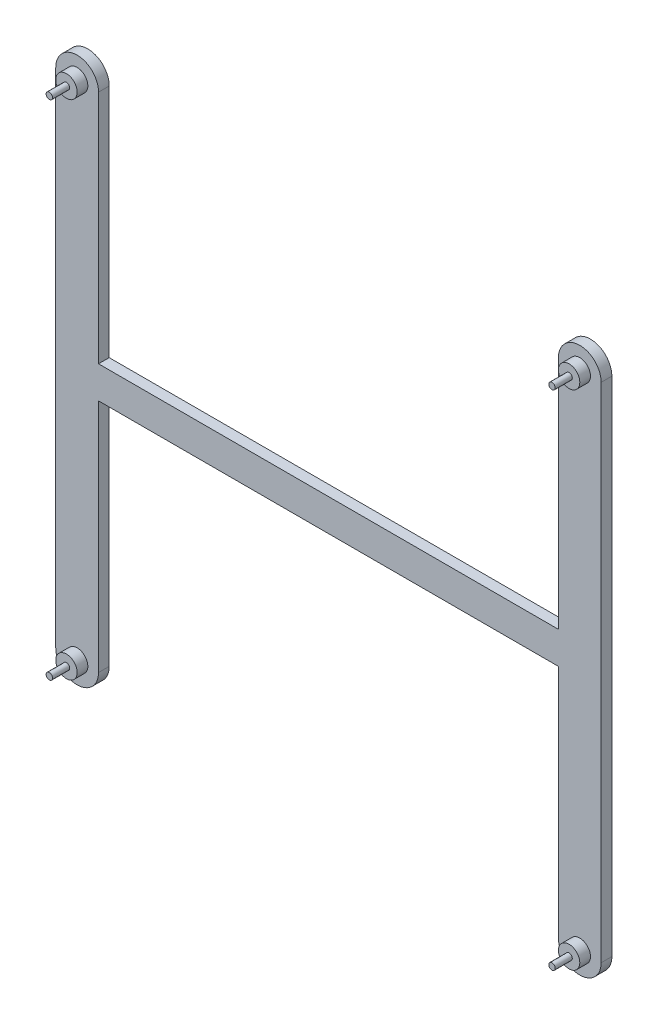
ISO-10303-21;
HEADER;
FILE_DESCRIPTION(('STEP AP214'),'2;1');
FILE_NAME('part.step','',(''),(''),'','','');
FILE_SCHEMA(('AUTOMOTIVE_DESIGN { 1 0 10303 214 1 1 1 1 }'));
ENDSEC;
DATA;
#1=APPLICATION_CONTEXT('core data for automotive mechanical design processes');
#2=APPLICATION_PROTOCOL_DEFINITION('international standard','automotive_design',2000,#1);
#3=PRODUCT_CONTEXT('',#1,'mechanical');
#4=PRODUCT('Part','Part','',(#3));
#5=PRODUCT_RELATED_PRODUCT_CATEGORY('part','',(#4));
#6=PRODUCT_DEFINITION_FORMATION('','',#4);
#7=PRODUCT_DEFINITION_CONTEXT('part definition',#1,'design');
#8=PRODUCT_DEFINITION('design','',#6,#7);
#9=PRODUCT_DEFINITION_SHAPE('','',#8);
#10=(LENGTH_UNIT() NAMED_UNIT(*) SI_UNIT(.MILLI.,.METRE.));
#11=(NAMED_UNIT(*) PLANE_ANGLE_UNIT() SI_UNIT($,.RADIAN.));
#12=(NAMED_UNIT(*) SI_UNIT($,.STERADIAN.) SOLID_ANGLE_UNIT());
#13=UNCERTAINTY_MEASURE_WITH_UNIT(LENGTH_MEASURE(1.E-05),#10,'distance_accuracy_value','');
#14=(GEOMETRIC_REPRESENTATION_CONTEXT(3) GLOBAL_UNCERTAINTY_ASSIGNED_CONTEXT((#13)) GLOBAL_UNIT_ASSIGNED_CONTEXT((#10,
#11,#12)) REPRESENTATION_CONTEXT('',''));
#15=CARTESIAN_POINT('',(0.,0.,0.));
#16=DIRECTION('',(0.,0.,1.));
#17=DIRECTION('',(1.,0.,0.));
#18=AXIS2_PLACEMENT_3D('',#15,#16,#17);
#19=CARTESIAN_POINT('',(107.5,117.5,5.));
#20=DIRECTION('',(1.,0.,0.));
#21=DIRECTION('',(0.,1.,0.));
#22=AXIS2_PLACEMENT_3D('',#19,#20,#21);
#23=PLANE('',#22);
#24=DIRECTION('',(0.,-1.,0.));
#25=VECTOR('',#24,1.);
#26=CARTESIAN_POINT('',(107.5,117.5,0.));
#27=LINE('',#26,#25);
#28=CARTESIAN_POINT('',(107.5,117.5,0.));
#29=VERTEX_POINT('',#28);
#30=CARTESIAN_POINT('',(107.5,7.50000000000006,0.));
#31=VERTEX_POINT('',#30);
#32=EDGE_CURVE('E160',#29,#31,#27,.T.);
#33=ORIENTED_EDGE('',*,*,#32,.T.);
#34=DIRECTION('',(0.,0.,-1.));
#35=VECTOR('',#34,1.);
#36=CARTESIAN_POINT('',(107.5,7.50000000000006,5.));
#37=LINE('',#36,#35);
#38=CARTESIAN_POINT('',(107.5,7.50000000000006,5.));
#39=VERTEX_POINT('',#38);
#40=EDGE_CURVE('E40',#39,#31,#37,.T.);
#41=ORIENTED_EDGE('',*,*,#40,.F.);
#42=DIRECTION('',(0.,-1.,0.));
#43=VECTOR('',#42,1.);
#44=CARTESIAN_POINT('',(107.5,117.5,5.));
#45=LINE('',#44,#43);
#46=CARTESIAN_POINT('',(107.5,117.5,5.));
#47=VERTEX_POINT('',#46);
#48=EDGE_CURVE('E183',#47,#39,#45,.T.);
#49=ORIENTED_EDGE('',*,*,#48,.F.);
#50=DIRECTION('',(0.,0.,-1.));
#51=VECTOR('',#50,1.);
#52=CARTESIAN_POINT('',(107.5,117.5,5.));
#53=LINE('',#52,#51);
#54=EDGE_CURVE('E156',#47,#29,#53,.T.);
#55=ORIENTED_EDGE('',*,*,#54,.T.);
#56=EDGE_LOOP('',(#33,#41,#49,#55));
#57=FACE_BOUND('',#56,.T.);
#58=ADVANCED_FACE('F37',(#57),#23,.F.);
#59=CARTESIAN_POINT('',(-107.499999999998,7.49999999999993,5.));
#60=DIRECTION('',(0.,-1.,0.));
#61=DIRECTION('',(1.,0.,0.));
#62=AXIS2_PLACEMENT_3D('',#59,#60,#61);
#63=PLANE('',#62);
#64=DIRECTION('',(-1.,0.,0.));
#65=VECTOR('',#64,1.);
#66=CARTESIAN_POINT('',(-107.499999999998,7.49999999999993,0.));
#67=LINE('',#66,#65);
#68=CARTESIAN_POINT('',(-107.499999999998,7.49999999999993,0.));
#69=VERTEX_POINT('',#68);
#70=EDGE_CURVE('E163',#31,#69,#67,.T.);
#71=ORIENTED_EDGE('',*,*,#70,.T.);
#72=DIRECTION('',(0.,0.,-1.));
#73=VECTOR('',#72,1.);
#74=CARTESIAN_POINT('',(-107.499999999998,7.49999999999993,5.));
#75=LINE('',#74,#73);
#76=CARTESIAN_POINT('',(-107.499999999998,7.49999999999993,5.));
#77=VERTEX_POINT('',#76);
#78=EDGE_CURVE('E204',#77,#69,#75,.T.);
#79=ORIENTED_EDGE('',*,*,#78,.F.);
#80=DIRECTION('',(-1.,0.,0.));
#81=VECTOR('',#80,1.);
#82=CARTESIAN_POINT('',(-107.499999999998,7.49999999999993,5.));
#83=LINE('',#82,#81);
#84=EDGE_CURVE('E111',#39,#77,#83,.T.);
#85=ORIENTED_EDGE('',*,*,#84,.F.);
#86=ORIENTED_EDGE('',*,*,#40,.T.);
#87=EDGE_LOOP('',(#71,#79,#85,#86));
#88=FACE_BOUND('',#87,.T.);
#89=ADVANCED_FACE('F284',(#88),#63,.F.);
#90=CARTESIAN_POINT('',(-107.499999999998,117.5,5.));
#91=DIRECTION('',(-1.,0.,0.));
#92=DIRECTION('',(0.,-1.,0.));
#93=AXIS2_PLACEMENT_3D('',#90,#91,#92);
#94=PLANE('',#93);
#95=DIRECTION('',(0.,1.,0.));
#96=VECTOR('',#95,1.);
#97=CARTESIAN_POINT('',(-107.499999999998,117.5,0.));
#98=LINE('',#97,#96);
#99=CARTESIAN_POINT('',(-107.499999999998,117.5,0.));
#100=VERTEX_POINT('',#99);
#101=EDGE_CURVE('E166',#69,#100,#98,.T.);
#102=ORIENTED_EDGE('',*,*,#101,.T.);
#103=DIRECTION('',(0.,0.,-1.));
#104=VECTOR('',#103,1.);
#105=CARTESIAN_POINT('',(-107.499999999998,117.5,5.));
#106=LINE('',#105,#104);
#107=CARTESIAN_POINT('',(-107.499999999998,117.5,5.));
#108=VERTEX_POINT('',#107);
#109=EDGE_CURVE('E202',#108,#100,#106,.T.);
#110=ORIENTED_EDGE('',*,*,#109,.F.);
#111=DIRECTION('',(0.,1.,0.));
#112=VECTOR('',#111,1.);
#113=CARTESIAN_POINT('',(-107.499999999998,117.5,5.));
#114=LINE('',#113,#112);
#115=EDGE_CURVE('E246',#77,#108,#114,.T.);
#116=ORIENTED_EDGE('',*,*,#115,.F.);
#117=ORIENTED_EDGE('',*,*,#78,.T.);
#118=EDGE_LOOP('',(#102,#110,#116,#117));
#119=FACE_BOUND('',#118,.T.);
#120=ADVANCED_FACE('F288',(#119),#94,.F.);
#121=CARTESIAN_POINT('',(-117.499999999998,117.5,5.));
#122=DIRECTION('',(0.,0.,-1.));
#123=DIRECTION('',(-1.,0.,0.));
#124=AXIS2_PLACEMENT_3D('',#121,#122,#123);
#125=CYLINDRICAL_SURFACE('',#124,9.99999999999997);
#126=CARTESIAN_POINT('',(-117.499999999998,117.5,0.));
#127=DIRECTION('',(0.,0.,1.));
#128=DIRECTION('',(1.,0.,0.));
#129=AXIS2_PLACEMENT_3D('',#126,#127,#128);
#130=CIRCLE('',#129,9.99999999999997);
#131=CARTESIAN_POINT('',(-127.499999999998,117.5,0.));
#132=VERTEX_POINT('',#131);
#133=EDGE_CURVE('E168',#100,#132,#130,.T.);
#134=ORIENTED_EDGE('',*,*,#133,.T.);
#135=DIRECTION('',(0.,0.,-1.));
#136=VECTOR('',#135,1.);
#137=CARTESIAN_POINT('',(-127.499999999998,117.5,5.));
#138=LINE('',#137,#136);
#139=CARTESIAN_POINT('',(-127.499999999998,117.5,5.));
#140=VERTEX_POINT('',#139);
#141=EDGE_CURVE('E199',#140,#132,#138,.T.);
#142=ORIENTED_EDGE('',*,*,#141,.F.);
#143=CARTESIAN_POINT('',(-117.499999999998,117.5,5.));
#144=DIRECTION('',(0.,0.,1.));
#145=DIRECTION('',(1.,0.,0.));
#146=AXIS2_PLACEMENT_3D('',#143,#144,#145);
#147=CIRCLE('',#146,9.99999999999997);
#148=EDGE_CURVE('E248',#108,#140,#147,.T.);
#149=ORIENTED_EDGE('',*,*,#148,.F.);
#150=ORIENTED_EDGE('',*,*,#109,.T.);
#151=EDGE_LOOP('',(#134,#142,#149,#150));
#152=FACE_BOUND('',#151,.T.);
#153=ADVANCED_FACE('F292',(#152),#125,.T.);
#154=CARTESIAN_POINT('',(-127.499999999998,117.5,5.));
#155=DIRECTION('',(1.,0.,0.));
#156=DIRECTION('',(0.,1.,0.));
#157=AXIS2_PLACEMENT_3D('',#154,#155,#156);
#158=PLANE('',#157);
#159=DIRECTION('',(0.,-1.,0.));
#160=VECTOR('',#159,1.);
#161=CARTESIAN_POINT('',(-127.499999999998,117.5,0.));
#162=LINE('',#161,#160);
#163=CARTESIAN_POINT('',(-127.499999999998,-117.5,0.));
#164=VERTEX_POINT('',#163);
#165=EDGE_CURVE('E170',#132,#164,#162,.T.);
#166=ORIENTED_EDGE('',*,*,#165,.T.);
#167=DIRECTION('',(0.,0.,-1.));
#168=VECTOR('',#167,1.);
#169=CARTESIAN_POINT('',(-127.499999999998,-117.5,5.));
#170=LINE('',#169,#168);
#171=CARTESIAN_POINT('',(-127.499999999998,-117.5,5.));
#172=VERTEX_POINT('',#171);
#173=EDGE_CURVE('E196',#172,#164,#170,.T.);
#174=ORIENTED_EDGE('',*,*,#173,.F.);
#175=DIRECTION('',(0.,-1.,0.));
#176=VECTOR('',#175,1.);
#177=CARTESIAN_POINT('',(-127.499999999998,117.5,5.));
#178=LINE('',#177,#176);
#179=EDGE_CURVE('E250',#140,#172,#178,.T.);
#180=ORIENTED_EDGE('',*,*,#179,.F.);
#181=ORIENTED_EDGE('',*,*,#141,.T.);
#182=EDGE_LOOP('',(#166,#174,#180,#181));
#183=FACE_BOUND('',#182,.T.);
#184=ADVANCED_FACE('F297',(#183),#158,.F.);
#185=CARTESIAN_POINT('',(-117.499999999998,-117.5,5.));
#186=DIRECTION('',(0.,0.,-1.));
#187=DIRECTION('',(-1.,0.,0.));
#188=AXIS2_PLACEMENT_3D('',#185,#186,#187);
#189=CYLINDRICAL_SURFACE('',#188,9.99999999999997);
#190=CARTESIAN_POINT('',(-117.499999999998,-117.5,0.));
#191=DIRECTION('',(0.,0.,1.));
#192=DIRECTION('',(1.,0.,0.));
#193=AXIS2_PLACEMENT_3D('',#190,#191,#192);
#194=CIRCLE('',#193,9.99999999999997);
#195=CARTESIAN_POINT('',(-107.499999999998,-117.5,0.));
#196=VERTEX_POINT('',#195);
#197=EDGE_CURVE('E172',#164,#196,#194,.T.);
#198=ORIENTED_EDGE('',*,*,#197,.T.);
#199=DIRECTION('',(0.,0.,-1.));
#200=VECTOR('',#199,1.);
#201=CARTESIAN_POINT('',(-107.499999999998,-117.5,5.));
#202=LINE('',#201,#200);
#203=CARTESIAN_POINT('',(-107.499999999998,-117.5,5.));
#204=VERTEX_POINT('',#203);
#205=EDGE_CURVE('E193',#204,#196,#202,.T.);
#206=ORIENTED_EDGE('',*,*,#205,.F.);
#207=CARTESIAN_POINT('',(-117.499999999998,-117.5,5.));
#208=DIRECTION('',(0.,0.,1.));
#209=DIRECTION('',(1.,0.,0.));
#210=AXIS2_PLACEMENT_3D('',#207,#208,#209);
#211=CIRCLE('',#210,9.99999999999997);
#212=EDGE_CURVE('E252',#172,#204,#211,.T.);
#213=ORIENTED_EDGE('',*,*,#212,.F.);
#214=ORIENTED_EDGE('',*,*,#173,.T.);
#215=EDGE_LOOP('',(#198,#206,#213,#214));
#216=FACE_BOUND('',#215,.T.);
#217=ADVANCED_FACE('F301',(#216),#189,.T.);
#218=CARTESIAN_POINT('',(-107.499999999998,-7.49999999999993,5.));
#219=DIRECTION('',(-1.,0.,0.));
#220=DIRECTION('',(0.,-1.,0.));
#221=AXIS2_PLACEMENT_3D('',#218,#219,#220);
#222=PLANE('',#221);
#223=DIRECTION('',(0.,1.,0.));
#224=VECTOR('',#223,1.);
#225=CARTESIAN_POINT('',(-107.499999999998,-7.49999999999993,0.));
#226=LINE('',#225,#224);
#227=CARTESIAN_POINT('',(-107.499999999998,-7.49999999999993,0.));
#228=VERTEX_POINT('',#227);
#229=EDGE_CURVE('E174',#196,#228,#226,.T.);
#230=ORIENTED_EDGE('',*,*,#229,.T.);
#231=DIRECTION('',(0.,0.,-1.));
#232=VECTOR('',#231,1.);
#233=CARTESIAN_POINT('',(-107.499999999998,-7.49999999999993,5.));
#234=LINE('',#233,#232);
#235=CARTESIAN_POINT('',(-107.499999999998,-7.49999999999993,5.));
#236=VERTEX_POINT('',#235);
#237=EDGE_CURVE('E190',#236,#228,#234,.T.);
#238=ORIENTED_EDGE('',*,*,#237,.F.);
#239=DIRECTION('',(0.,1.,0.));
#240=VECTOR('',#239,1.);
#241=CARTESIAN_POINT('',(-107.499999999998,-7.49999999999993,5.));
#242=LINE('',#241,#240);
#243=EDGE_CURVE('E254',#204,#236,#242,.T.);
#244=ORIENTED_EDGE('',*,*,#243,.F.);
#245=ORIENTED_EDGE('',*,*,#205,.T.);
#246=EDGE_LOOP('',(#230,#238,#244,#245));
#247=FACE_BOUND('',#246,.T.);
#248=ADVANCED_FACE('F305',(#247),#222,.F.);
#249=CARTESIAN_POINT('',(-107.499999999998,-7.49999999999993,5.));
#250=DIRECTION('',(0.,1.,0.));
#251=DIRECTION('',(0.,0.,1.));
#252=AXIS2_PLACEMENT_3D('',#249,#250,#251);
#253=PLANE('',#252);
#254=DIRECTION('',(1.,0.,0.));
#255=VECTOR('',#254,1.);
#256=CARTESIAN_POINT('',(-107.499999999998,-7.49999999999993,0.));
#257=LINE('',#256,#255);
#258=CARTESIAN_POINT('',(107.5,-7.49999999999993,0.));
#259=VERTEX_POINT('',#258);
#260=EDGE_CURVE('E176',#228,#259,#257,.T.);
#261=ORIENTED_EDGE('',*,*,#260,.T.);
#262=DIRECTION('',(0.,0.,-1.));
#263=VECTOR('',#262,1.);
#264=CARTESIAN_POINT('',(107.5,-7.49999999999993,5.));
#265=LINE('',#264,#263);
#266=CARTESIAN_POINT('',(107.5,-7.49999999999993,5.));
#267=VERTEX_POINT('',#266);
#268=EDGE_CURVE('E187',#267,#259,#265,.T.);
#269=ORIENTED_EDGE('',*,*,#268,.F.);
#270=DIRECTION('',(1.,0.,0.));
#271=VECTOR('',#270,1.);
#272=CARTESIAN_POINT('',(-107.499999999998,-7.49999999999993,5.));
#273=LINE('',#272,#271);
#274=EDGE_CURVE('E256',#236,#267,#273,.T.);
#275=ORIENTED_EDGE('',*,*,#274,.F.);
#276=ORIENTED_EDGE('',*,*,#237,.T.);
#277=EDGE_LOOP('',(#261,#269,#275,#276));
#278=FACE_BOUND('',#277,.T.);
#279=ADVANCED_FACE('F262',(#278),#253,.F.);
#280=CARTESIAN_POINT('',(107.5,-7.49999999999993,5.));
#281=DIRECTION('',(1.,0.,0.));
#282=DIRECTION('',(0.,0.,-1.));
#283=AXIS2_PLACEMENT_3D('',#280,#281,#282);
#284=PLANE('',#283);
#285=DIRECTION('',(0.,-1.,0.));
#286=VECTOR('',#285,1.);
#287=CARTESIAN_POINT('',(107.5,-7.49999999999993,0.));
#288=LINE('',#287,#286);
#289=CARTESIAN_POINT('',(107.5,-117.5,0.));
#290=VERTEX_POINT('',#289);
#291=EDGE_CURVE('E178',#259,#290,#288,.T.);
#292=ORIENTED_EDGE('',*,*,#291,.T.);
#293=DIRECTION('',(0.,0.,-1.));
#294=VECTOR('',#293,1.);
#295=CARTESIAN_POINT('',(107.5,-117.5,5.));
#296=LINE('',#295,#294);
#297=CARTESIAN_POINT('',(107.5,-117.5,5.));
#298=VERTEX_POINT('',#297);
#299=EDGE_CURVE('E151',#298,#290,#296,.T.);
#300=ORIENTED_EDGE('',*,*,#299,.F.);
#301=DIRECTION('',(0.,-1.,0.));
#302=VECTOR('',#301,1.);
#303=CARTESIAN_POINT('',(107.5,-7.49999999999993,5.));
#304=LINE('',#303,#302);
#305=EDGE_CURVE('E142',#267,#298,#304,.T.);
#306=ORIENTED_EDGE('',*,*,#305,.F.);
#307=ORIENTED_EDGE('',*,*,#268,.T.);
#308=EDGE_LOOP('',(#292,#300,#306,#307));
#309=FACE_BOUND('',#308,.T.);
#310=ADVANCED_FACE('F266',(#309),#284,.F.);
#311=CARTESIAN_POINT('',(117.5,-117.5,5.));
#312=DIRECTION('',(0.,0.,-1.));
#313=DIRECTION('',(-1.,0.,0.));
#314=AXIS2_PLACEMENT_3D('',#311,#312,#313);
#315=CYLINDRICAL_SURFACE('',#314,10.);
#316=CARTESIAN_POINT('',(117.5,-117.5,0.));
#317=DIRECTION('',(0.,0.,1.));
#318=DIRECTION('',(1.,0.,0.));
#319=AXIS2_PLACEMENT_3D('',#316,#317,#318);
#320=CIRCLE('',#319,10.);
#321=CARTESIAN_POINT('',(127.5,-117.5,0.));
#322=VERTEX_POINT('',#321);
#323=EDGE_CURVE('E150',#290,#322,#320,.T.);
#324=ORIENTED_EDGE('',*,*,#323,.T.);
#325=DIRECTION('',(0.,0.,-1.));
#326=VECTOR('',#325,1.);
#327=CARTESIAN_POINT('',(127.5,-117.5,5.));
#328=LINE('',#327,#326);
#329=CARTESIAN_POINT('',(127.5,-117.5,5.));
#330=VERTEX_POINT('',#329);
#331=EDGE_CURVE('E147',#330,#322,#328,.T.);
#332=ORIENTED_EDGE('',*,*,#331,.F.);
#333=CARTESIAN_POINT('',(117.5,-117.5,5.));
#334=DIRECTION('',(0.,0.,1.));
#335=DIRECTION('',(1.,0.,0.));
#336=AXIS2_PLACEMENT_3D('',#333,#334,#335);
#337=CIRCLE('',#336,10.);
#338=EDGE_CURVE('E136',#298,#330,#337,.T.);
#339=ORIENTED_EDGE('',*,*,#338,.F.);
#340=ORIENTED_EDGE('',*,*,#299,.T.);
#341=EDGE_LOOP('',(#324,#332,#339,#340));
#342=FACE_BOUND('',#341,.T.);
#343=ADVANCED_FACE('F148',(#342),#315,.T.);
#344=CARTESIAN_POINT('',(127.5,117.5,5.));
#345=DIRECTION('',(-1.,0.,0.));
#346=DIRECTION('',(0.,-1.,0.));
#347=AXIS2_PLACEMENT_3D('',#344,#345,#346);
#348=PLANE('',#347);
#349=DIRECTION('',(0.,1.,0.));
#350=VECTOR('',#349,1.);
#351=CARTESIAN_POINT('',(127.5,117.5,0.));
#352=LINE('',#351,#350);
#353=CARTESIAN_POINT('',(127.5,117.5,0.));
#354=VERTEX_POINT('',#353);
#355=EDGE_CURVE('E96',#322,#354,#352,.T.);
#356=ORIENTED_EDGE('',*,*,#355,.T.);
#357=DIRECTION('',(0.,0.,-1.));
#358=VECTOR('',#357,1.);
#359=CARTESIAN_POINT('',(127.5,117.5,5.));
#360=LINE('',#359,#358);
#361=CARTESIAN_POINT('',(127.5,117.5,5.));
#362=VERTEX_POINT('',#361);
#363=EDGE_CURVE('E152',#362,#354,#360,.T.);
#364=ORIENTED_EDGE('',*,*,#363,.F.);
#365=DIRECTION('',(0.,1.,0.));
#366=VECTOR('',#365,1.);
#367=CARTESIAN_POINT('',(127.5,117.5,5.));
#368=LINE('',#367,#366);
#369=EDGE_CURVE('E140',#330,#362,#368,.T.);
#370=ORIENTED_EDGE('',*,*,#369,.F.);
#371=ORIENTED_EDGE('',*,*,#331,.T.);
#372=EDGE_LOOP('',(#356,#364,#370,#371));
#373=FACE_BOUND('',#372,.T.);
#374=ADVANCED_FACE('F154',(#373),#348,.F.);
#375=CARTESIAN_POINT('',(117.5,117.5,5.));
#376=DIRECTION('',(0.,0.,-1.));
#377=DIRECTION('',(-1.,0.,0.));
#378=AXIS2_PLACEMENT_3D('',#375,#376,#377);
#379=CYLINDRICAL_SURFACE('',#378,10.);
#380=CARTESIAN_POINT('',(117.5,117.5,0.));
#381=DIRECTION('',(0.,0.,1.));
#382=DIRECTION('',(1.,0.,0.));
#383=AXIS2_PLACEMENT_3D('',#380,#381,#382);
#384=CIRCLE('',#383,10.);
#385=EDGE_CURVE('E102',#354,#29,#384,.T.);
#386=ORIENTED_EDGE('',*,*,#385,.T.);
#387=ORIENTED_EDGE('',*,*,#54,.F.);
#388=CARTESIAN_POINT('',(117.5,117.5,5.));
#389=DIRECTION('',(0.,0.,1.));
#390=DIRECTION('',(1.,0.,0.));
#391=AXIS2_PLACEMENT_3D('',#388,#389,#390);
#392=CIRCLE('',#391,10.);
#393=EDGE_CURVE('E55',#362,#47,#392,.T.);
#394=ORIENTED_EDGE('',*,*,#393,.F.);
#395=ORIENTED_EDGE('',*,*,#363,.T.);
#396=EDGE_LOOP('',(#386,#387,#394,#395));
#397=FACE_BOUND('',#396,.T.);
#398=ADVANCED_FACE('F272',(#397),#379,.T.);
#399=CARTESIAN_POINT('',(-117.499999999998,117.5,5.));
#400=DIRECTION('',(0.,0.,1.));
#401=DIRECTION('',(1.,0.,0.));
#402=AXIS2_PLACEMENT_3D('',#399,#400,#401);
#403=PLANE('',#402);
#404=CARTESIAN_POINT('',(-117.499999999998,-117.5,5.));
#405=DIRECTION('',(0.,0.,1.));
#406=DIRECTION('',(1.,0.,0.));
#407=AXIS2_PLACEMENT_3D('',#404,#405,#406);
#408=CIRCLE('',#407,5.00000000000001);
#409=CARTESIAN_POINT('',(-112.499999999998,-117.5,5.));
#410=VERTEX_POINT('',#409);
#411=EDGE_CURVE('E225',#410,#410,#408,.T.);
#412=ORIENTED_EDGE('',*,*,#411,.F.);
#413=EDGE_LOOP('',(#412));
#414=FACE_BOUND('',#413,.T.);
#415=CARTESIAN_POINT('',(-117.499999999998,117.5,5.));
#416=DIRECTION('',(0.,0.,1.));
#417=DIRECTION('',(1.,0.,0.));
#418=AXIS2_PLACEMENT_3D('',#415,#416,#417);
#419=CIRCLE('',#418,5.00000000000001);
#420=CARTESIAN_POINT('',(-112.499999999998,117.5,5.));
#421=VERTEX_POINT('',#420);
#422=EDGE_CURVE('E224',#421,#421,#419,.T.);
#423=ORIENTED_EDGE('',*,*,#422,.F.);
#424=EDGE_LOOP('',(#423));
#425=FACE_BOUND('',#424,.T.);
#426=CARTESIAN_POINT('',(117.5,117.5,5.));
#427=DIRECTION('',(0.,0.,1.));
#428=DIRECTION('',(1.,0.,0.));
#429=AXIS2_PLACEMENT_3D('',#426,#427,#428);
#430=CIRCLE('',#429,5.00000000000001);
#431=CARTESIAN_POINT('',(122.5,117.5,5.));
#432=VERTEX_POINT('',#431);
#433=EDGE_CURVE('E231',#432,#432,#430,.T.);
#434=ORIENTED_EDGE('',*,*,#433,.F.);
#435=EDGE_LOOP('',(#434));
#436=FACE_BOUND('',#435,.T.);
#437=CARTESIAN_POINT('',(117.5,-117.5,5.));
#438=DIRECTION('',(0.,0.,1.));
#439=DIRECTION('',(1.,0.,0.));
#440=AXIS2_PLACEMENT_3D('',#437,#438,#439);
#441=CIRCLE('',#440,5.00000000000001);
#442=CARTESIAN_POINT('',(122.5,-117.5,5.));
#443=VERTEX_POINT('',#442);
#444=EDGE_CURVE('E237',#443,#443,#441,.T.);
#445=ORIENTED_EDGE('',*,*,#444,.F.);
#446=EDGE_LOOP('',(#445));
#447=FACE_BOUND('',#446,.T.);
#448=ORIENTED_EDGE('',*,*,#48,.T.);
#449=ORIENTED_EDGE('',*,*,#84,.T.);
#450=ORIENTED_EDGE('',*,*,#115,.T.);
#451=ORIENTED_EDGE('',*,*,#148,.T.);
#452=ORIENTED_EDGE('',*,*,#179,.T.);
#453=ORIENTED_EDGE('',*,*,#212,.T.);
#454=ORIENTED_EDGE('',*,*,#243,.T.);
#455=ORIENTED_EDGE('',*,*,#274,.T.);
#456=ORIENTED_EDGE('',*,*,#305,.T.);
#457=ORIENTED_EDGE('',*,*,#338,.T.);
#458=ORIENTED_EDGE('',*,*,#369,.T.);
#459=ORIENTED_EDGE('',*,*,#393,.T.);
#460=EDGE_LOOP('',(#448,#449,#450,#451,#452,#453,#454,#455,#456,#457,#458,#459));
#461=FACE_BOUND('',#460,.T.);
#462=ADVANCED_FACE('F138',(#414,#425,#436,#447,#461),#403,.T.);
#463=CARTESIAN_POINT('',(-117.499999999998,117.5,0.));
#464=DIRECTION('',(0.,0.,1.));
#465=DIRECTION('',(1.,0.,0.));
#466=AXIS2_PLACEMENT_3D('',#463,#464,#465);
#467=PLANE('',#466);
#468=ORIENTED_EDGE('',*,*,#32,.F.);
#469=ORIENTED_EDGE('',*,*,#385,.F.);
#470=ORIENTED_EDGE('',*,*,#355,.F.);
#471=ORIENTED_EDGE('',*,*,#323,.F.);
#472=ORIENTED_EDGE('',*,*,#291,.F.);
#473=ORIENTED_EDGE('',*,*,#260,.F.);
#474=ORIENTED_EDGE('',*,*,#229,.F.);
#475=ORIENTED_EDGE('',*,*,#197,.F.);
#476=ORIENTED_EDGE('',*,*,#165,.F.);
#477=ORIENTED_EDGE('',*,*,#133,.F.);
#478=ORIENTED_EDGE('',*,*,#101,.F.);
#479=ORIENTED_EDGE('',*,*,#70,.F.);
#480=EDGE_LOOP('',(#468,#469,#470,#471,#472,#473,#474,#475,#476,#477,#478,#479));
#481=FACE_BOUND('',#480,.T.);
#482=ADVANCED_FACE('F269',(#481),#467,.F.);
#483=CARTESIAN_POINT('',(117.5,-117.5,10.));
#484=DIRECTION('',(0.,0.,-1.));
#485=DIRECTION('',(-1.,0.,0.));
#486=AXIS2_PLACEMENT_3D('',#483,#484,#485);
#487=CYLINDRICAL_SURFACE('',#486,5.00000000000001);
#488=CARTESIAN_POINT('',(117.5,-117.5,10.));
#489=DIRECTION('',(0.,0.,1.));
#490=DIRECTION('',(1.,0.,0.));
#491=AXIS2_PLACEMENT_3D('',#488,#489,#490);
#492=CIRCLE('',#491,5.00000000000001);
#493=CARTESIAN_POINT('',(122.5,-117.5,10.));
#494=VERTEX_POINT('',#493);
#495=EDGE_CURVE('E164',#494,#494,#492,.T.);
#496=ORIENTED_EDGE('',*,*,#495,.F.);
#497=EDGE_LOOP('',(#496));
#498=FACE_BOUND('',#497,.T.);
#499=ORIENTED_EDGE('',*,*,#444,.T.);
#500=EDGE_LOOP('',(#499));
#501=FACE_BOUND('',#500,.T.);
#502=ADVANCED_FACE('F337',(#498,#501),#487,.T.);
#503=CARTESIAN_POINT('',(117.5,-117.5,10.));
#504=DIRECTION('',(0.,0.,1.));
#505=DIRECTION('',(1.,0.,0.));
#506=AXIS2_PLACEMENT_3D('',#503,#504,#505);
#507=PLANE('',#506);
#508=CARTESIAN_POINT('',(117.5,-117.5,10.));
#509=DIRECTION('',(0.,0.,1.));
#510=DIRECTION('',(1.,0.,0.));
#511=AXIS2_PLACEMENT_3D('',#508,#509,#510);
#512=CIRCLE('',#511,1.5);
#513=CARTESIAN_POINT('',(119.,-117.5,10.));
#514=VERTEX_POINT('',#513);
#515=EDGE_CURVE('E46',#514,#514,#512,.T.);
#516=ORIENTED_EDGE('',*,*,#515,.F.);
#517=EDGE_LOOP('',(#516));
#518=FACE_BOUND('',#517,.T.);
#519=ORIENTED_EDGE('',*,*,#495,.T.);
#520=EDGE_LOOP('',(#519));
#521=FACE_BOUND('',#520,.T.);
#522=ADVANCED_FACE('F350',(#518,#521),#507,.T.);
#523=CARTESIAN_POINT('',(117.5,117.5,10.));
#524=DIRECTION('',(0.,0.,-1.));
#525=DIRECTION('',(-1.,0.,0.));
#526=AXIS2_PLACEMENT_3D('',#523,#524,#525);
#527=CYLINDRICAL_SURFACE('',#526,5.00000000000001);
#528=CARTESIAN_POINT('',(117.5,117.5,10.));
#529=DIRECTION('',(0.,0.,1.));
#530=DIRECTION('',(1.,0.,0.));
#531=AXIS2_PLACEMENT_3D('',#528,#529,#530);
#532=CIRCLE('',#531,5.00000000000001);
#533=CARTESIAN_POINT('',(122.5,117.5,10.));
#534=VERTEX_POINT('',#533);
#535=EDGE_CURVE('E234',#534,#534,#532,.T.);
#536=ORIENTED_EDGE('',*,*,#535,.F.);
#537=EDGE_LOOP('',(#536));
#538=FACE_BOUND('',#537,.T.);
#539=ORIENTED_EDGE('',*,*,#433,.T.);
#540=EDGE_LOOP('',(#539));
#541=FACE_BOUND('',#540,.T.);
#542=ADVANCED_FACE('F358',(#538,#541),#527,.T.);
#543=CARTESIAN_POINT('',(117.5,117.5,10.));
#544=DIRECTION('',(0.,0.,1.));
#545=DIRECTION('',(1.,0.,0.));
#546=AXIS2_PLACEMENT_3D('',#543,#544,#545);
#547=PLANE('',#546);
#548=CARTESIAN_POINT('',(117.5,117.5,10.));
#549=DIRECTION('',(0.,0.,1.));
#550=DIRECTION('',(1.,0.,0.));
#551=AXIS2_PLACEMENT_3D('',#548,#549,#550);
#552=CIRCLE('',#551,1.5);
#553=CARTESIAN_POINT('',(119.,117.5,10.));
#554=VERTEX_POINT('',#553);
#555=EDGE_CURVE('E11',#554,#554,#552,.T.);
#556=ORIENTED_EDGE('',*,*,#555,.F.);
#557=EDGE_LOOP('',(#556));
#558=FACE_BOUND('',#557,.T.);
#559=ORIENTED_EDGE('',*,*,#535,.T.);
#560=EDGE_LOOP('',(#559));
#561=FACE_BOUND('',#560,.T.);
#562=ADVANCED_FACE('F363',(#558,#561),#547,.T.);
#563=CARTESIAN_POINT('',(-117.499999999998,117.5,10.));
#564=DIRECTION('',(0.,0.,-1.));
#565=DIRECTION('',(-1.,0.,0.));
#566=AXIS2_PLACEMENT_3D('',#563,#564,#565);
#567=CYLINDRICAL_SURFACE('',#566,5.00000000000001);
#568=CARTESIAN_POINT('',(-117.499999999998,117.5,10.));
#569=DIRECTION('',(0.,0.,1.));
#570=DIRECTION('',(1.,0.,0.));
#571=AXIS2_PLACEMENT_3D('',#568,#569,#570);
#572=CIRCLE('',#571,5.00000000000001);
#573=CARTESIAN_POINT('',(-112.499999999998,117.5,10.));
#574=VERTEX_POINT('',#573);
#575=EDGE_CURVE('E228',#574,#574,#572,.T.);
#576=ORIENTED_EDGE('',*,*,#575,.F.);
#577=EDGE_LOOP('',(#576));
#578=FACE_BOUND('',#577,.T.);
#579=ORIENTED_EDGE('',*,*,#422,.T.);
#580=EDGE_LOOP('',(#579));
#581=FACE_BOUND('',#580,.T.);
#582=ADVANCED_FACE('F371',(#578,#581),#567,.T.);
#583=CARTESIAN_POINT('',(-117.499999999998,117.5,10.));
#584=DIRECTION('',(0.,0.,1.));
#585=DIRECTION('',(1.,0.,0.));
#586=AXIS2_PLACEMENT_3D('',#583,#584,#585);
#587=PLANE('',#586);
#588=CARTESIAN_POINT('',(-117.499999999998,117.5,10.));
#589=DIRECTION('',(0.,0.,1.));
#590=DIRECTION('',(1.,0.,0.));
#591=AXIS2_PLACEMENT_3D('',#588,#589,#590);
#592=CIRCLE('',#591,1.5);
#593=CARTESIAN_POINT('',(-115.999999999998,117.5,10.));
#594=VERTEX_POINT('',#593);
#595=EDGE_CURVE('E209',#594,#594,#592,.T.);
#596=ORIENTED_EDGE('',*,*,#595,.F.);
#597=EDGE_LOOP('',(#596));
#598=FACE_BOUND('',#597,.T.);
#599=ORIENTED_EDGE('',*,*,#575,.T.);
#600=EDGE_LOOP('',(#599));
#601=FACE_BOUND('',#600,.T.);
#602=ADVANCED_FACE('F376',(#598,#601),#587,.T.);
#603=CARTESIAN_POINT('',(-117.499999999998,-117.5,10.));
#604=DIRECTION('',(0.,0.,-1.));
#605=DIRECTION('',(-1.,0.,0.));
#606=AXIS2_PLACEMENT_3D('',#603,#604,#605);
#607=CYLINDRICAL_SURFACE('',#606,5.00000000000001);
#608=CARTESIAN_POINT('',(-117.499999999998,-117.5,10.));
#609=DIRECTION('',(0.,0.,1.));
#610=DIRECTION('',(1.,0.,0.));
#611=AXIS2_PLACEMENT_3D('',#608,#609,#610);
#612=CIRCLE('',#611,5.00000000000001);
#613=CARTESIAN_POINT('',(-112.499999999998,-117.5,10.));
#614=VERTEX_POINT('',#613);
#615=EDGE_CURVE('E221',#614,#614,#612,.T.);
#616=ORIENTED_EDGE('',*,*,#615,.F.);
#617=EDGE_LOOP('',(#616));
#618=FACE_BOUND('',#617,.T.);
#619=ORIENTED_EDGE('',*,*,#411,.T.);
#620=EDGE_LOOP('',(#619));
#621=FACE_BOUND('',#620,.T.);
#622=ADVANCED_FACE('F384',(#618,#621),#607,.T.);
#623=CARTESIAN_POINT('',(-117.499999999998,-117.5,10.));
#624=DIRECTION('',(0.,0.,1.));
#625=DIRECTION('',(1.,0.,0.));
#626=AXIS2_PLACEMENT_3D('',#623,#624,#625);
#627=PLANE('',#626);
#628=CARTESIAN_POINT('',(-117.499999999998,-117.5,10.));
#629=DIRECTION('',(0.,0.,1.));
#630=DIRECTION('',(1.,0.,0.));
#631=AXIS2_PLACEMENT_3D('',#628,#629,#630);
#632=CIRCLE('',#631,1.5);
#633=CARTESIAN_POINT('',(-115.999999999998,-117.5,10.));
#634=VERTEX_POINT('',#633);
#635=EDGE_CURVE('E212',#634,#634,#632,.T.);
#636=ORIENTED_EDGE('',*,*,#635,.F.);
#637=EDGE_LOOP('',(#636));
#638=FACE_BOUND('',#637,.T.);
#639=ORIENTED_EDGE('',*,*,#615,.T.);
#640=EDGE_LOOP('',(#639));
#641=FACE_BOUND('',#640,.T.);
#642=ADVANCED_FACE('F389',(#638,#641),#627,.T.);
#643=CARTESIAN_POINT('',(-117.499999999998,117.5,18.));
#644=DIRECTION('',(0.,0.,-1.));
#645=DIRECTION('',(-1.,0.,0.));
#646=AXIS2_PLACEMENT_3D('',#643,#644,#645);
#647=CYLINDRICAL_SURFACE('',#646,1.5);
#648=CARTESIAN_POINT('',(-117.499999999998,117.5,18.));
#649=DIRECTION('',(0.,0.,1.));
#650=DIRECTION('',(1.,0.,0.));
#651=AXIS2_PLACEMENT_3D('',#648,#649,#650);
#652=CIRCLE('',#651,1.5);
#653=CARTESIAN_POINT('',(-115.999999999998,117.5,18.));
#654=VERTEX_POINT('',#653);
#655=EDGE_CURVE('E220',#654,#654,#652,.T.);
#656=ORIENTED_EDGE('',*,*,#655,.F.);
#657=EDGE_LOOP('',(#656));
#658=FACE_BOUND('',#657,.T.);
#659=ORIENTED_EDGE('',*,*,#595,.T.);
#660=EDGE_LOOP('',(#659));
#661=FACE_BOUND('',#660,.T.);
#662=ADVANCED_FACE('F420',(#658,#661),#647,.T.);
#663=CARTESIAN_POINT('',(-117.499999999998,117.5,18.));
#664=DIRECTION('',(0.,0.,1.));
#665=DIRECTION('',(1.,0.,0.));
#666=AXIS2_PLACEMENT_3D('',#663,#664,#665);
#667=PLANE('',#666);
#668=ORIENTED_EDGE('',*,*,#655,.T.);
#669=EDGE_LOOP('',(#668));
#670=FACE_BOUND('',#669,.T.);
#671=ADVANCED_FACE('F430',(#670),#667,.T.);
#672=CARTESIAN_POINT('',(-117.499999999998,-117.5,18.));
#673=DIRECTION('',(0.,0.,-1.));
#674=DIRECTION('',(-1.,0.,0.));
#675=AXIS2_PLACEMENT_3D('',#672,#673,#674);
#676=CYLINDRICAL_SURFACE('',#675,1.5);
#677=CARTESIAN_POINT('',(-117.499999999998,-117.5,18.));
#678=DIRECTION('',(0.,0.,1.));
#679=DIRECTION('',(1.,0.,0.));
#680=AXIS2_PLACEMENT_3D('',#677,#678,#679);
#681=CIRCLE('',#680,1.5);
#682=CARTESIAN_POINT('',(-115.999999999998,-117.5,18.));
#683=VERTEX_POINT('',#682);
#684=EDGE_CURVE('E510',#683,#683,#681,.T.);
#685=ORIENTED_EDGE('',*,*,#684,.F.);
#686=EDGE_LOOP('',(#685));
#687=FACE_BOUND('',#686,.T.);
#688=ORIENTED_EDGE('',*,*,#635,.T.);
#689=EDGE_LOOP('',(#688));
#690=FACE_BOUND('',#689,.T.);
#691=ADVANCED_FACE('F440',(#687,#690),#676,.T.);
#692=CARTESIAN_POINT('',(-117.499999999998,-117.5,18.));
#693=DIRECTION('',(0.,0.,1.));
#694=DIRECTION('',(1.,0.,0.));
#695=AXIS2_PLACEMENT_3D('',#692,#693,#694);
#696=PLANE('',#695);
#697=ORIENTED_EDGE('',*,*,#684,.T.);
#698=EDGE_LOOP('',(#697));
#699=FACE_BOUND('',#698,.T.);
#700=ADVANCED_FACE('F450',(#699),#696,.T.);
#701=CARTESIAN_POINT('',(117.5,-117.5,18.));
#702=DIRECTION('',(0.,0.,-1.));
#703=DIRECTION('',(-1.,0.,0.));
#704=AXIS2_PLACEMENT_3D('',#701,#702,#703);
#705=CYLINDRICAL_SURFACE('',#704,1.5);
#706=CARTESIAN_POINT('',(117.5,-117.5,18.));
#707=DIRECTION('',(0.,0.,1.));
#708=DIRECTION('',(1.,0.,0.));
#709=AXIS2_PLACEMENT_3D('',#706,#707,#708);
#710=CIRCLE('',#709,1.5);
#711=CARTESIAN_POINT('',(119.,-117.5,18.));
#712=VERTEX_POINT('',#711);
#713=EDGE_CURVE('E507',#712,#712,#710,.T.);
#714=ORIENTED_EDGE('',*,*,#713,.F.);
#715=EDGE_LOOP('',(#714));
#716=FACE_BOUND('',#715,.T.);
#717=ORIENTED_EDGE('',*,*,#515,.T.);
#718=EDGE_LOOP('',(#717));
#719=FACE_BOUND('',#718,.T.);
#720=ADVANCED_FACE('F460',(#716,#719),#705,.T.);
#721=CARTESIAN_POINT('',(117.5,-117.5,18.));
#722=DIRECTION('',(0.,0.,1.));
#723=DIRECTION('',(1.,0.,0.));
#724=AXIS2_PLACEMENT_3D('',#721,#722,#723);
#725=PLANE('',#724);
#726=ORIENTED_EDGE('',*,*,#713,.T.);
#727=EDGE_LOOP('',(#726));
#728=FACE_BOUND('',#727,.T.);
#729=ADVANCED_FACE('F470',(#728),#725,.T.);
#730=CARTESIAN_POINT('',(117.5,117.5,18.));
#731=DIRECTION('',(0.,0.,-1.));
#732=DIRECTION('',(-1.,0.,0.));
#733=AXIS2_PLACEMENT_3D('',#730,#731,#732);
#734=CYLINDRICAL_SURFACE('',#733,1.5);
#735=CARTESIAN_POINT('',(117.5,117.5,18.));
#736=DIRECTION('',(0.,0.,1.));
#737=DIRECTION('',(1.,0.,0.));
#738=AXIS2_PLACEMENT_3D('',#735,#736,#737);
#739=CIRCLE('',#738,1.5);
#740=CARTESIAN_POINT('',(119.,117.5,18.));
#741=VERTEX_POINT('',#740);
#742=EDGE_CURVE('E506',#741,#741,#739,.T.);
#743=ORIENTED_EDGE('',*,*,#742,.F.);
#744=EDGE_LOOP('',(#743));
#745=FACE_BOUND('',#744,.T.);
#746=ORIENTED_EDGE('',*,*,#555,.T.);
#747=EDGE_LOOP('',(#746));
#748=FACE_BOUND('',#747,.T.);
#749=ADVANCED_FACE('F480',(#745,#748),#734,.T.);
#750=CARTESIAN_POINT('',(117.5,117.5,18.));
#751=DIRECTION('',(0.,0.,1.));
#752=DIRECTION('',(1.,0.,0.));
#753=AXIS2_PLACEMENT_3D('',#750,#751,#752);
#754=PLANE('',#753);
#755=ORIENTED_EDGE('',*,*,#742,.T.);
#756=EDGE_LOOP('',(#755));
#757=FACE_BOUND('',#756,.T.);
#758=ADVANCED_FACE('F490',(#757),#754,.T.);
#759=CLOSED_SHELL('',(#58,#89,#120,#153,#184,#217,#248,#279,#310,#343,#374,#398,#462,#482,#502,
#522,#542,#562,#582,#602,#622,#642,#662,#671,#691,#700,#720,#729,#749,#758));
#760=MANIFOLD_SOLID_BREP('B2',#759);
#761=ADVANCED_BREP_SHAPE_REPRESENTATION('',(#18,#760),#14);
#762=SHAPE_DEFINITION_REPRESENTATION(#9,#761);
ENDSEC;
END-ISO-10303-21;
